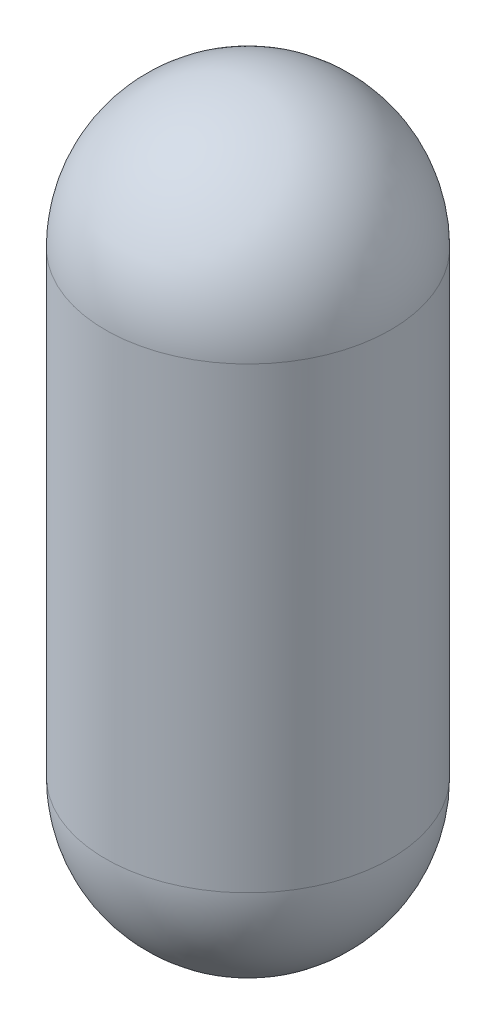
ISO-10303-21;
HEADER;
FILE_DESCRIPTION(('STEP AP214'),'2;1');
FILE_NAME('part.step','',(''),(''),'','','');
FILE_SCHEMA(('AUTOMOTIVE_DESIGN { 1 0 10303 214 1 1 1 1 }'));
ENDSEC;
DATA;
#1=APPLICATION_CONTEXT('core data for automotive mechanical design processes');
#2=APPLICATION_PROTOCOL_DEFINITION('international standard','automotive_design',2000,#1);
#3=PRODUCT_CONTEXT('',#1,'mechanical');
#4=PRODUCT('Part','Part','',(#3));
#5=PRODUCT_RELATED_PRODUCT_CATEGORY('part','',(#4));
#6=PRODUCT_DEFINITION_FORMATION('','',#4);
#7=PRODUCT_DEFINITION_CONTEXT('part definition',#1,'design');
#8=PRODUCT_DEFINITION('design','',#6,#7);
#9=PRODUCT_DEFINITION_SHAPE('','',#8);
#10=(LENGTH_UNIT() NAMED_UNIT(*) SI_UNIT(.MILLI.,.METRE.));
#11=(NAMED_UNIT(*) PLANE_ANGLE_UNIT() SI_UNIT($,.RADIAN.));
#12=(NAMED_UNIT(*) SI_UNIT($,.STERADIAN.) SOLID_ANGLE_UNIT());
#13=UNCERTAINTY_MEASURE_WITH_UNIT(LENGTH_MEASURE(1.E-05),#10,'distance_accuracy_value','');
#14=(GEOMETRIC_REPRESENTATION_CONTEXT(3) GLOBAL_UNCERTAINTY_ASSIGNED_CONTEXT((#13)) GLOBAL_UNIT_ASSIGNED_CONTEXT((#10,
#11,#12)) REPRESENTATION_CONTEXT('',''));
#15=CARTESIAN_POINT('',(0.,0.,0.));
#16=DIRECTION('',(0.,0.,1.));
#17=DIRECTION('',(1.,0.,0.));
#18=AXIS2_PLACEMENT_3D('',#15,#16,#17);
#19=CARTESIAN_POINT('',(0.,1386.4,0.));
#20=DIRECTION('',(0.,-1.,0.));
#21=DIRECTION('',(1.,0.,0.));
#22=AXIS2_PLACEMENT_3D('',#19,#20,#21);
#23=SPHERICAL_SURFACE('',#22,431.8);
#24=CARTESIAN_POINT('',(0.,1386.4,0.));
#25=DIRECTION('',(0.,-1.,0.));
#26=DIRECTION('',(0.,0.,-1.));
#27=AXIS2_PLACEMENT_3D('',#24,#25,#26);
#28=CIRCLE('',#27,431.8);
#29=CARTESIAN_POINT('',(0.,1386.4,-431.8));
#30=VERTEX_POINT('',#29);
#31=EDGE_CURVE('E52',#30,#30,#28,.T.);
#32=ORIENTED_EDGE('',*,*,#31,.F.);
#33=EDGE_LOOP('',(#32));
#34=FACE_BOUND('',#33,.T.);
#35=ADVANCED_FACE('F37',(#34),#23,.T.);
#36=CARTESIAN_POINT('',(0.,0.,0.));
#37=DIRECTION('',(0.,-1.,0.));
#38=DIRECTION('',(-1.,0.,0.));
#39=AXIS2_PLACEMENT_3D('',#36,#37,#38);
#40=SPHERICAL_SURFACE('',#39,431.8);
#41=CARTESIAN_POINT('',(0.,0.,0.));
#42=DIRECTION('',(0.,-1.,0.));
#43=DIRECTION('',(0.,0.,-1.));
#44=AXIS2_PLACEMENT_3D('',#41,#42,#43);
#45=CIRCLE('',#44,431.8);
#46=CARTESIAN_POINT('',(0.,0.,-431.8));
#47=VERTEX_POINT('',#46);
#48=EDGE_CURVE('E48',#47,#47,#45,.T.);
#49=ORIENTED_EDGE('',*,*,#48,.T.);
#50=EDGE_LOOP('',(#49));
#51=FACE_BOUND('',#50,.T.);
#52=ADVANCED_FACE('F62',(#51),#40,.T.);
#53=CARTESIAN_POINT('',(0.,0.,0.));
#54=DIRECTION('',(0.,-1.,0.));
#55=DIRECTION('',(0.,0.,-1.));
#56=AXIS2_PLACEMENT_3D('',#53,#54,#55);
#57=CYLINDRICAL_SURFACE('',#56,431.8);
#58=ORIENTED_EDGE('',*,*,#31,.T.);
#59=EDGE_LOOP('',(#58));
#60=FACE_BOUND('',#59,.T.);
#61=ORIENTED_EDGE('',*,*,#48,.F.);
#62=EDGE_LOOP('',(#61));
#63=FACE_BOUND('',#62,.T.);
#64=ADVANCED_FACE('F58',(#60,#63),#57,.T.);
#65=CLOSED_SHELL('',(#35,#52,#64));
#66=CARTESIAN_POINT('',(0.,1386.4,0.));
#67=DIRECTION('',(0.,-1.,0.));
#68=DIRECTION('',(1.,0.,0.));
#69=AXIS2_PLACEMENT_3D('',#66,#67,#68);
#70=SPHERICAL_SURFACE('',#69,429.26);
#71=CARTESIAN_POINT('',(0.,1386.4,0.));
#72=DIRECTION('',(0.,-1.,0.));
#73=DIRECTION('',(0.,0.,-1.));
#74=AXIS2_PLACEMENT_3D('',#71,#72,#73);
#75=CIRCLE('',#74,429.26);
#76=CARTESIAN_POINT('',(0.,1386.4,-429.26));
#77=VERTEX_POINT('',#76);
#78=EDGE_CURVE('E10',#77,#77,#75,.T.);
#79=ORIENTED_EDGE('',*,*,#78,.T.);
#80=EDGE_LOOP('',(#79));
#81=FACE_BOUND('',#80,.T.);
#82=ADVANCED_FACE('F80',(#81),#70,.F.);
#83=CARTESIAN_POINT('',(0.,0.,0.));
#84=DIRECTION('',(0.,-1.,0.));
#85=DIRECTION('',(0.,0.,-1.));
#86=AXIS2_PLACEMENT_3D('',#83,#84,#85);
#87=CYLINDRICAL_SURFACE('',#86,429.26);
#88=CARTESIAN_POINT('',(0.,0.,0.));
#89=DIRECTION('',(0.,-1.,0.));
#90=DIRECTION('',(0.,0.,-1.));
#91=AXIS2_PLACEMENT_3D('',#88,#89,#90);
#92=CIRCLE('',#91,429.26);
#93=CARTESIAN_POINT('',(0.,0.,-429.26));
#94=VERTEX_POINT('',#93);
#95=EDGE_CURVE('E44',#94,#94,#92,.T.);
#96=ORIENTED_EDGE('',*,*,#95,.T.);
#97=EDGE_LOOP('',(#96));
#98=FACE_BOUND('',#97,.T.);
#99=ORIENTED_EDGE('',*,*,#78,.F.);
#100=EDGE_LOOP('',(#99));
#101=FACE_BOUND('',#100,.T.);
#102=ADVANCED_FACE('F76',(#98,#101),#87,.F.);
#103=CARTESIAN_POINT('',(0.,0.,0.));
#104=DIRECTION('',(0.,-1.,0.));
#105=DIRECTION('',(1.,0.,0.));
#106=AXIS2_PLACEMENT_3D('',#103,#104,#105);
#107=SPHERICAL_SURFACE('',#106,429.26);
#108=ORIENTED_EDGE('',*,*,#95,.F.);
#109=EDGE_LOOP('',(#108));
#110=FACE_BOUND('',#109,.T.);
#111=ADVANCED_FACE('F73',(#110),#107,.F.);
#112=CLOSED_SHELL('',(#82,#102,#111));
#113=ORIENTED_CLOSED_SHELL('',*,#112,.T.);
#114=BREP_WITH_VOIDS('B2',#65,(#113));
#115=ADVANCED_BREP_SHAPE_REPRESENTATION('',(#18,#114),#14);
#116=SHAPE_DEFINITION_REPRESENTATION(#9,#115);
ENDSEC;
END-ISO-10303-21;
